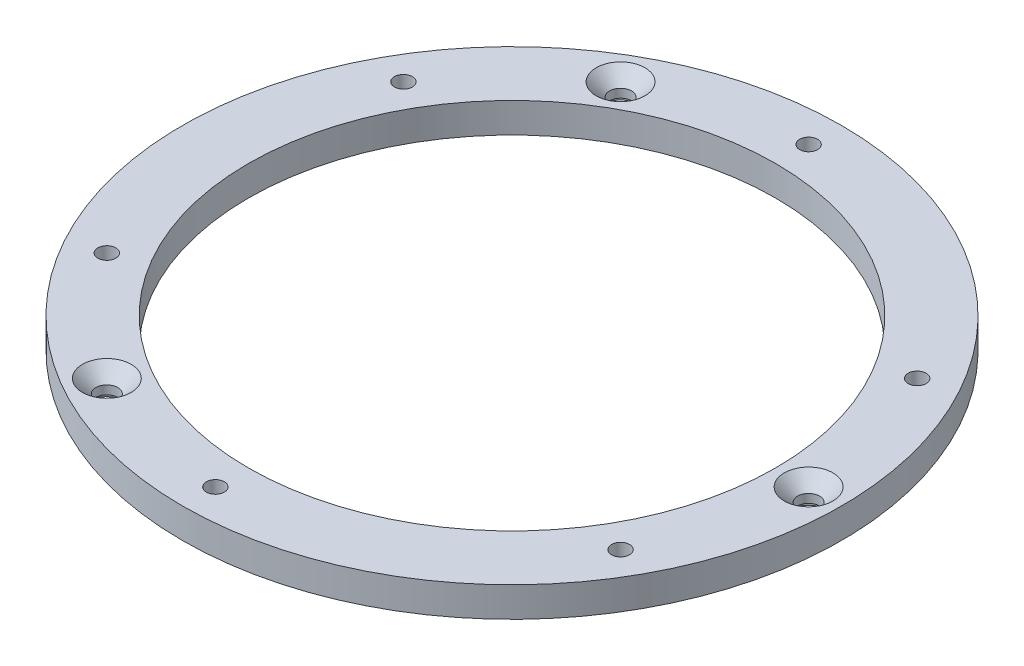
ISO-10303-21;
HEADER;
FILE_DESCRIPTION(('STEP AP214'),'2;1');
FILE_NAME('part.step','',(''),(''),'','','');
FILE_SCHEMA(('AUTOMOTIVE_DESIGN { 1 0 10303 214 1 1 1 1 }'));
ENDSEC;
DATA;
#1=APPLICATION_CONTEXT('core data for automotive mechanical design processes');
#2=APPLICATION_PROTOCOL_DEFINITION('international standard','automotive_design',2000,#1);
#3=PRODUCT_CONTEXT('',#1,'mechanical');
#4=PRODUCT('Part','Part','',(#3));
#5=PRODUCT_RELATED_PRODUCT_CATEGORY('part','',(#4));
#6=PRODUCT_DEFINITION_FORMATION('','',#4);
#7=PRODUCT_DEFINITION_CONTEXT('part definition',#1,'design');
#8=PRODUCT_DEFINITION('design','',#6,#7);
#9=PRODUCT_DEFINITION_SHAPE('','',#8);
#10=(LENGTH_UNIT() NAMED_UNIT(*) SI_UNIT(.MILLI.,.METRE.));
#11=(NAMED_UNIT(*) PLANE_ANGLE_UNIT() SI_UNIT($,.RADIAN.));
#12=(NAMED_UNIT(*) SI_UNIT($,.STERADIAN.) SOLID_ANGLE_UNIT());
#13=UNCERTAINTY_MEASURE_WITH_UNIT(LENGTH_MEASURE(1.E-05),#10,'distance_accuracy_value','');
#14=(GEOMETRIC_REPRESENTATION_CONTEXT(3) GLOBAL_UNCERTAINTY_ASSIGNED_CONTEXT((#13)) GLOBAL_UNIT_ASSIGNED_CONTEXT((#10,
#11,#12)) REPRESENTATION_CONTEXT('',''));
#15=CARTESIAN_POINT('',(0.,0.,0.));
#16=DIRECTION('',(0.,0.,1.));
#17=DIRECTION('',(1.,0.,0.));
#18=AXIS2_PLACEMENT_3D('',#15,#16,#17);
#19=CARTESIAN_POINT('',(0.,15.,0.));
#20=DIRECTION('',(0.,1.,0.));
#21=DIRECTION('',(0.,0.,1.));
#22=AXIS2_PLACEMENT_3D('',#19,#20,#21);
#23=PLANE('',#22);
#24=CARTESIAN_POINT('',(-74.2500000000016,15.,-128.604772461988));
#25=DIRECTION('',(0.,1.,0.));
#26=DIRECTION('',(0.,0.,1.));
#27=AXIS2_PLACEMENT_3D('',#24,#25,#26);
#28=CIRCLE('',#27,12.2);
#29=CARTESIAN_POINT('',(-74.2500000000016,15.,-116.404772461988));
#30=VERTEX_POINT('',#29);
#31=EDGE_CURVE('E163',#30,#30,#28,.T.);
#32=ORIENTED_EDGE('',*,*,#31,.F.);
#33=EDGE_LOOP('',(#32));
#34=FACE_BOUND('',#33,.T.);
#35=CARTESIAN_POINT('',(148.5,15.,-1.11022302462516E-12));
#36=DIRECTION('',(0.,1.,0.));
#37=DIRECTION('',(0.,0.,1.));
#38=AXIS2_PLACEMENT_3D('',#35,#36,#37);
#39=CIRCLE('',#38,12.2);
#40=CARTESIAN_POINT('',(148.5,15.,12.1999999999989));
#41=VERTEX_POINT('',#40);
#42=EDGE_CURVE('E72',#41,#41,#39,.T.);
#43=ORIENTED_EDGE('',*,*,#42,.F.);
#44=EDGE_LOOP('',(#43));
#45=FACE_BOUND('',#44,.T.);
#46=CARTESIAN_POINT('',(-74.2499999999998,15.,128.60477246199));
#47=DIRECTION('',(0.,1.,0.));
#48=DIRECTION('',(0.,0.,1.));
#49=AXIS2_PLACEMENT_3D('',#46,#47,#48);
#50=CIRCLE('',#49,12.2);
#51=CARTESIAN_POINT('',(-74.2499999999998,15.,140.80477246199));
#52=VERTEX_POINT('',#51);
#53=EDGE_CURVE('E83',#52,#52,#50,.T.);
#54=ORIENTED_EDGE('',*,*,#53,.F.);
#55=EDGE_LOOP('',(#54));
#56=FACE_BOUND('',#55,.T.);
#57=CARTESIAN_POINT('',(128.604772461988,15.,-74.2500000000016));
#58=DIRECTION('',(0.,-1.,0.));
#59=DIRECTION('',(0.,0.,-1.));
#60=AXIS2_PLACEMENT_3D('',#57,#58,#59);
#61=CIRCLE('',#60,4.5);
#62=CARTESIAN_POINT('',(128.604772461988,15.,-78.7500000000016));
#63=VERTEX_POINT('',#62);
#64=EDGE_CURVE('E101',#63,#63,#61,.T.);
#65=ORIENTED_EDGE('',*,*,#64,.T.);
#66=EDGE_LOOP('',(#65));
#67=FACE_BOUND('',#66,.T.);
#68=CARTESIAN_POINT('',(128.60477246199,15.,74.2499999999989));
#69=DIRECTION('',(0.,-1.,0.));
#70=DIRECTION('',(0.,0.,-1.));
#71=AXIS2_PLACEMENT_3D('',#68,#69,#70);
#72=CIRCLE('',#71,4.5);
#73=CARTESIAN_POINT('',(128.60477246199,15.,69.7499999999989));
#74=VERTEX_POINT('',#73);
#75=EDGE_CURVE('E107',#74,#74,#72,.T.);
#76=ORIENTED_EDGE('',*,*,#75,.T.);
#77=EDGE_LOOP('',(#76));
#78=FACE_BOUND('',#77,.T.);
#79=CARTESIAN_POINT('',(0.,15.,148.5));
#80=DIRECTION('',(0.,-1.,0.));
#81=DIRECTION('',(0.,0.,-1.));
#82=AXIS2_PLACEMENT_3D('',#79,#80,#81);
#83=CIRCLE('',#82,4.5);
#84=CARTESIAN_POINT('',(0.,15.,144.));
#85=VERTEX_POINT('',#84);
#86=EDGE_CURVE('E113',#85,#85,#83,.T.);
#87=ORIENTED_EDGE('',*,*,#86,.T.);
#88=EDGE_LOOP('',(#87));
#89=FACE_BOUND('',#88,.T.);
#90=CARTESIAN_POINT('',(-128.604772461989,15.,74.2500000000007));
#91=DIRECTION('',(0.,-1.,0.));
#92=DIRECTION('',(0.,0.,-1.));
#93=AXIS2_PLACEMENT_3D('',#90,#91,#92);
#94=CIRCLE('',#93,4.5);
#95=CARTESIAN_POINT('',(-128.604772461989,15.,69.7500000000007));
#96=VERTEX_POINT('',#95);
#97=EDGE_CURVE('E119',#96,#96,#94,.T.);
#98=ORIENTED_EDGE('',*,*,#97,.T.);
#99=EDGE_LOOP('',(#98));
#100=FACE_BOUND('',#99,.T.);
#101=CARTESIAN_POINT('',(-128.60477246199,15.,-74.2499999999998));
#102=DIRECTION('',(0.,-1.,0.));
#103=DIRECTION('',(0.,0.,-1.));
#104=AXIS2_PLACEMENT_3D('',#101,#102,#103);
#105=CIRCLE('',#104,4.5);
#106=CARTESIAN_POINT('',(-128.60477246199,15.,-78.7499999999998));
#107=VERTEX_POINT('',#106);
#108=EDGE_CURVE('E125',#107,#107,#105,.T.);
#109=ORIENTED_EDGE('',*,*,#108,.T.);
#110=EDGE_LOOP('',(#109));
#111=FACE_BOUND('',#110,.T.);
#112=CARTESIAN_POINT('',(0.,15.,-148.5));
#113=DIRECTION('',(0.,-1.,0.));
#114=DIRECTION('',(0.,0.,-1.));
#115=AXIS2_PLACEMENT_3D('',#112,#113,#114);
#116=CIRCLE('',#115,4.5);
#117=CARTESIAN_POINT('',(0.,15.,-153.));
#118=VERTEX_POINT('',#117);
#119=EDGE_CURVE('E131',#118,#118,#116,.T.);
#120=ORIENTED_EDGE('',*,*,#119,.T.);
#121=EDGE_LOOP('',(#120));
#122=FACE_BOUND('',#121,.T.);
#123=CARTESIAN_POINT('',(0.,15.,0.));
#124=DIRECTION('',(0.,1.,0.));
#125=DIRECTION('',(0.,0.,1.));
#126=AXIS2_PLACEMENT_3D('',#123,#124,#125);
#127=CIRCLE('',#126,165.);
#128=CARTESIAN_POINT('',(0.,15.,165.));
#129=VERTEX_POINT('',#128);
#130=EDGE_CURVE('E10',#129,#129,#127,.T.);
#131=ORIENTED_EDGE('',*,*,#130,.T.);
#132=EDGE_LOOP('',(#131));
#133=FACE_BOUND('',#132,.T.);
#134=CARTESIAN_POINT('',(0.,15.,0.));
#135=DIRECTION('',(0.,1.,0.));
#136=DIRECTION('',(0.,0.,1.));
#137=AXIS2_PLACEMENT_3D('',#134,#135,#136);
#138=CIRCLE('',#137,132.);
#139=CARTESIAN_POINT('',(0.,15.,132.));
#140=VERTEX_POINT('',#139);
#141=EDGE_CURVE('E52',#140,#140,#138,.T.);
#142=ORIENTED_EDGE('',*,*,#141,.F.);
#143=EDGE_LOOP('',(#142));
#144=FACE_BOUND('',#143,.T.);
#145=ADVANCED_FACE('F39',(#34,#45,#56,#67,#78,#89,#100,#111,#122,#133,#144),#23,.T.);
#146=CARTESIAN_POINT('',(0.,0.,0.));
#147=DIRECTION('',(0.,1.,0.));
#148=DIRECTION('',(0.,0.,1.));
#149=AXIS2_PLACEMENT_3D('',#146,#147,#148);
#150=PLANE('',#149);
#151=CARTESIAN_POINT('',(148.5,0.,-1.11022302462516E-12));
#152=DIRECTION('',(0.,-1.,0.));
#153=DIRECTION('',(-0.866025403784438,0.,0.500000000000005));
#154=AXIS2_PLACEMENT_3D('',#151,#152,#153);
#155=CIRCLE('',#154,9.99999999999998);
#156=CARTESIAN_POINT('',(139.839745962156,0.,4.99999999999893));
#157=VERTEX_POINT('',#156);
#158=EDGE_CURVE('E84',#157,#157,#155,.T.);
#159=ORIENTED_EDGE('',*,*,#158,.F.);
#160=EDGE_LOOP('',(#159));
#161=FACE_BOUND('',#160,.T.);
#162=CARTESIAN_POINT('',(-74.2500000000016,0.,-128.604772461988));
#163=DIRECTION('',(0.,-1.,0.));
#164=DIRECTION('',(0.866025403784445,0.,0.499999999999993));
#165=AXIS2_PLACEMENT_3D('',#162,#163,#164);
#166=CIRCLE('',#165,9.99999999999998);
#167=CARTESIAN_POINT('',(-65.5897459621572,0.,-123.604772461988));
#168=VERTEX_POINT('',#167);
#169=EDGE_CURVE('E64',#168,#168,#166,.T.);
#170=ORIENTED_EDGE('',*,*,#169,.F.);
#171=EDGE_LOOP('',(#170));
#172=FACE_BOUND('',#171,.T.);
#173=CARTESIAN_POINT('',(-74.2499999999998,0.,128.60477246199));
#174=DIRECTION('',(0.,-1.,0.));
#175=DIRECTION('',(0.,0.,-1.));
#176=AXIS2_PLACEMENT_3D('',#173,#174,#175);
#177=CIRCLE('',#176,9.99999999999998);
#178=CARTESIAN_POINT('',(-74.2499999999998,0.,118.60477246199));
#179=VERTEX_POINT('',#178);
#180=EDGE_CURVE('E60',#179,#179,#177,.T.);
#181=ORIENTED_EDGE('',*,*,#180,.F.);
#182=EDGE_LOOP('',(#181));
#183=FACE_BOUND('',#182,.T.);
#184=CARTESIAN_POINT('',(128.604772461988,0.,-74.2500000000016));
#185=DIRECTION('',(0.,-1.,0.));
#186=DIRECTION('',(0.,0.,-1.));
#187=AXIS2_PLACEMENT_3D('',#184,#185,#186);
#188=CIRCLE('',#187,4.5);
#189=CARTESIAN_POINT('',(128.604772461988,0.,-78.7500000000016));
#190=VERTEX_POINT('',#189);
#191=EDGE_CURVE('E96',#190,#190,#188,.T.);
#192=ORIENTED_EDGE('',*,*,#191,.F.);
#193=EDGE_LOOP('',(#192));
#194=FACE_BOUND('',#193,.T.);
#195=CARTESIAN_POINT('',(128.60477246199,0.,74.2499999999989));
#196=DIRECTION('',(0.,-1.,0.));
#197=DIRECTION('',(0.,0.,-1.));
#198=AXIS2_PLACEMENT_3D('',#195,#196,#197);
#199=CIRCLE('',#198,4.5);
#200=CARTESIAN_POINT('',(128.60477246199,0.,69.7499999999989));
#201=VERTEX_POINT('',#200);
#202=EDGE_CURVE('E104',#201,#201,#199,.T.);
#203=ORIENTED_EDGE('',*,*,#202,.F.);
#204=EDGE_LOOP('',(#203));
#205=FACE_BOUND('',#204,.T.);
#206=CARTESIAN_POINT('',(0.,0.,148.5));
#207=DIRECTION('',(0.,-1.,0.));
#208=DIRECTION('',(0.,0.,-1.));
#209=AXIS2_PLACEMENT_3D('',#206,#207,#208);
#210=CIRCLE('',#209,4.5);
#211=CARTESIAN_POINT('',(0.,0.,144.));
#212=VERTEX_POINT('',#211);
#213=EDGE_CURVE('E110',#212,#212,#210,.T.);
#214=ORIENTED_EDGE('',*,*,#213,.F.);
#215=EDGE_LOOP('',(#214));
#216=FACE_BOUND('',#215,.T.);
#217=CARTESIAN_POINT('',(-128.604772461989,0.,74.2500000000007));
#218=DIRECTION('',(0.,-1.,0.));
#219=DIRECTION('',(0.,0.,-1.));
#220=AXIS2_PLACEMENT_3D('',#217,#218,#219);
#221=CIRCLE('',#220,4.5);
#222=CARTESIAN_POINT('',(-128.604772461989,0.,69.7500000000007));
#223=VERTEX_POINT('',#222);
#224=EDGE_CURVE('E116',#223,#223,#221,.T.);
#225=ORIENTED_EDGE('',*,*,#224,.F.);
#226=EDGE_LOOP('',(#225));
#227=FACE_BOUND('',#226,.T.);
#228=CARTESIAN_POINT('',(-128.60477246199,0.,-74.2499999999998));
#229=DIRECTION('',(0.,-1.,0.));
#230=DIRECTION('',(0.,0.,-1.));
#231=AXIS2_PLACEMENT_3D('',#228,#229,#230);
#232=CIRCLE('',#231,4.5);
#233=CARTESIAN_POINT('',(-128.60477246199,0.,-78.7499999999998));
#234=VERTEX_POINT('',#233);
#235=EDGE_CURVE('E122',#234,#234,#232,.T.);
#236=ORIENTED_EDGE('',*,*,#235,.F.);
#237=EDGE_LOOP('',(#236));
#238=FACE_BOUND('',#237,.T.);
#239=CARTESIAN_POINT('',(0.,0.,-148.5));
#240=DIRECTION('',(0.,-1.,0.));
#241=DIRECTION('',(0.,0.,-1.));
#242=AXIS2_PLACEMENT_3D('',#239,#240,#241);
#243=CIRCLE('',#242,4.5);
#244=CARTESIAN_POINT('',(0.,0.,-153.));
#245=VERTEX_POINT('',#244);
#246=EDGE_CURVE('E128',#245,#245,#243,.T.);
#247=ORIENTED_EDGE('',*,*,#246,.F.);
#248=EDGE_LOOP('',(#247));
#249=FACE_BOUND('',#248,.T.);
#250=CARTESIAN_POINT('',(0.,0.,0.));
#251=DIRECTION('',(0.,1.,0.));
#252=DIRECTION('',(0.,0.,1.));
#253=AXIS2_PLACEMENT_3D('',#250,#251,#252);
#254=CIRCLE('',#253,165.);
#255=CARTESIAN_POINT('',(0.,0.,165.));
#256=VERTEX_POINT('',#255);
#257=EDGE_CURVE('E47',#256,#256,#254,.T.);
#258=ORIENTED_EDGE('',*,*,#257,.F.);
#259=EDGE_LOOP('',(#258));
#260=FACE_BOUND('',#259,.T.);
#261=CARTESIAN_POINT('',(0.,0.,0.));
#262=DIRECTION('',(0.,1.,0.));
#263=DIRECTION('',(0.,0.,1.));
#264=AXIS2_PLACEMENT_3D('',#261,#262,#263);
#265=CIRCLE('',#264,132.);
#266=CARTESIAN_POINT('',(0.,0.,132.));
#267=VERTEX_POINT('',#266);
#268=EDGE_CURVE('E55',#267,#267,#265,.T.);
#269=ORIENTED_EDGE('',*,*,#268,.T.);
#270=EDGE_LOOP('',(#269));
#271=FACE_BOUND('',#270,.T.);
#272=ADVANCED_FACE('F139',(#161,#172,#183,#194,#205,#216,#227,#238,#249,#260,#271),#150,.F.);
#273=CARTESIAN_POINT('',(0.,15.,0.));
#274=DIRECTION('',(0.,-1.,0.));
#275=DIRECTION('',(0.,0.,-1.));
#276=AXIS2_PLACEMENT_3D('',#273,#274,#275);
#277=CYLINDRICAL_SURFACE('',#276,165.);
#278=ORIENTED_EDGE('',*,*,#130,.F.);
#279=EDGE_LOOP('',(#278));
#280=FACE_BOUND('',#279,.T.);
#281=ORIENTED_EDGE('',*,*,#257,.T.);
#282=EDGE_LOOP('',(#281));
#283=FACE_BOUND('',#282,.T.);
#284=ADVANCED_FACE('F41',(#280,#283),#277,.T.);
#285=CARTESIAN_POINT('',(0.,15.,0.));
#286=DIRECTION('',(0.,-1.,0.));
#287=DIRECTION('',(0.,0.,-1.));
#288=AXIS2_PLACEMENT_3D('',#285,#286,#287);
#289=CYLINDRICAL_SURFACE('',#288,132.);
#290=ORIENTED_EDGE('',*,*,#141,.T.);
#291=EDGE_LOOP('',(#290));
#292=FACE_BOUND('',#291,.T.);
#293=ORIENTED_EDGE('',*,*,#268,.F.);
#294=EDGE_LOOP('',(#293));
#295=FACE_BOUND('',#294,.T.);
#296=ADVANCED_FACE('F141',(#292,#295),#289,.F.);
#297=CARTESIAN_POINT('',(0.,0.,-148.5));
#298=DIRECTION('',(0.,-1.,0.));
#299=DIRECTION('',(0.,0.,-1.));
#300=AXIS2_PLACEMENT_3D('',#297,#298,#299);
#301=CYLINDRICAL_SURFACE('',#300,4.5);
#302=ORIENTED_EDGE('',*,*,#119,.F.);
#303=EDGE_LOOP('',(#302));
#304=FACE_BOUND('',#303,.T.);
#305=ORIENTED_EDGE('',*,*,#246,.T.);
#306=EDGE_LOOP('',(#305));
#307=FACE_BOUND('',#306,.T.);
#308=ADVANCED_FACE('F143',(#304,#307),#301,.F.);
#309=CARTESIAN_POINT('',(-128.60477246199,0.,-74.2499999999998));
#310=DIRECTION('',(0.,-1.,0.));
#311=DIRECTION('',(0.,0.,-1.));
#312=AXIS2_PLACEMENT_3D('',#309,#310,#311);
#313=CYLINDRICAL_SURFACE('',#312,4.5);
#314=ORIENTED_EDGE('',*,*,#108,.F.);
#315=EDGE_LOOP('',(#314));
#316=FACE_BOUND('',#315,.T.);
#317=ORIENTED_EDGE('',*,*,#235,.T.);
#318=EDGE_LOOP('',(#317));
#319=FACE_BOUND('',#318,.T.);
#320=ADVANCED_FACE('F149',(#316,#319),#313,.F.);
#321=CARTESIAN_POINT('',(-128.604772461989,0.,74.2500000000007));
#322=DIRECTION('',(0.,-1.,0.));
#323=DIRECTION('',(0.,0.,-1.));
#324=AXIS2_PLACEMENT_3D('',#321,#322,#323);
#325=CYLINDRICAL_SURFACE('',#324,4.5);
#326=ORIENTED_EDGE('',*,*,#97,.F.);
#327=EDGE_LOOP('',(#326));
#328=FACE_BOUND('',#327,.T.);
#329=ORIENTED_EDGE('',*,*,#224,.T.);
#330=EDGE_LOOP('',(#329));
#331=FACE_BOUND('',#330,.T.);
#332=ADVANCED_FACE('F189',(#328,#331),#325,.F.);
#333=CARTESIAN_POINT('',(0.,0.,148.5));
#334=DIRECTION('',(0.,-1.,0.));
#335=DIRECTION('',(0.,0.,-1.));
#336=AXIS2_PLACEMENT_3D('',#333,#334,#335);
#337=CYLINDRICAL_SURFACE('',#336,4.5);
#338=ORIENTED_EDGE('',*,*,#86,.F.);
#339=EDGE_LOOP('',(#338));
#340=FACE_BOUND('',#339,.T.);
#341=ORIENTED_EDGE('',*,*,#213,.T.);
#342=EDGE_LOOP('',(#341));
#343=FACE_BOUND('',#342,.T.);
#344=ADVANCED_FACE('F196',(#340,#343),#337,.F.);
#345=CARTESIAN_POINT('',(128.60477246199,0.,74.2499999999989));
#346=DIRECTION('',(0.,-1.,0.));
#347=DIRECTION('',(0.,0.,-1.));
#348=AXIS2_PLACEMENT_3D('',#345,#346,#347);
#349=CYLINDRICAL_SURFACE('',#348,4.5);
#350=ORIENTED_EDGE('',*,*,#75,.F.);
#351=EDGE_LOOP('',(#350));
#352=FACE_BOUND('',#351,.T.);
#353=ORIENTED_EDGE('',*,*,#202,.T.);
#354=EDGE_LOOP('',(#353));
#355=FACE_BOUND('',#354,.T.);
#356=ADVANCED_FACE('F202',(#352,#355),#349,.F.);
#357=CARTESIAN_POINT('',(128.604772461988,0.,-74.2500000000016));
#358=DIRECTION('',(0.,-1.,0.));
#359=DIRECTION('',(0.,0.,-1.));
#360=AXIS2_PLACEMENT_3D('',#357,#358,#359);
#361=CYLINDRICAL_SURFACE('',#360,4.5);
#362=ORIENTED_EDGE('',*,*,#64,.F.);
#363=EDGE_LOOP('',(#362));
#364=FACE_BOUND('',#363,.T.);
#365=ORIENTED_EDGE('',*,*,#191,.T.);
#366=EDGE_LOOP('',(#365));
#367=FACE_BOUND('',#366,.T.);
#368=ADVANCED_FACE('F206',(#364,#367),#361,.F.);
#369=CARTESIAN_POINT('',(-74.2499999999998,4.,128.60477246199));
#370=DIRECTION('',(0.,-1.,0.));
#371=DIRECTION('',(0.,0.,-1.));
#372=AXIS2_PLACEMENT_3D('',#369,#370,#371);
#373=CYLINDRICAL_SURFACE('',#372,9.99999999999998);
#374=CARTESIAN_POINT('',(-74.2499999999998,4.,128.60477246199));
#375=DIRECTION('',(0.,-1.,0.));
#376=DIRECTION('',(0.,0.,-1.));
#377=AXIS2_PLACEMENT_3D('',#374,#375,#376);
#378=CIRCLE('',#377,9.99999999999998);
#379=CARTESIAN_POINT('',(-74.2499999999998,4.,118.60477246199));
#380=VERTEX_POINT('',#379);
#381=EDGE_CURVE('E93',#380,#380,#378,.T.);
#382=ORIENTED_EDGE('',*,*,#381,.F.);
#383=EDGE_LOOP('',(#382));
#384=FACE_BOUND('',#383,.T.);
#385=ORIENTED_EDGE('',*,*,#180,.T.);
#386=EDGE_LOOP('',(#385));
#387=FACE_BOUND('',#386,.T.);
#388=ADVANCED_FACE('F210',(#384,#387),#373,.F.);
#389=CARTESIAN_POINT('',(-74.2499999999998,4.,128.60477246199));
#390=DIRECTION('',(0.,-1.,0.));
#391=DIRECTION('',(0.,0.,-1.));
#392=AXIS2_PLACEMENT_3D('',#389,#390,#391);
#393=PLANE('',#392);
#394=CARTESIAN_POINT('',(-74.2499999999998,4.,128.60477246199));
#395=DIRECTION('',(0.,-1.,0.));
#396=DIRECTION('',(0.,0.,-1.));
#397=AXIS2_PLACEMENT_3D('',#394,#395,#396);
#398=CIRCLE('',#397,5.49999999999999);
#399=CARTESIAN_POINT('',(-74.2499999999998,4.,123.10477246199));
#400=VERTEX_POINT('',#399);
#401=EDGE_CURVE('E58',#400,#400,#398,.T.);
#402=ORIENTED_EDGE('',*,*,#401,.F.);
#403=EDGE_LOOP('',(#402));
#404=FACE_BOUND('',#403,.T.);
#405=ORIENTED_EDGE('',*,*,#381,.T.);
#406=EDGE_LOOP('',(#405));
#407=FACE_BOUND('',#406,.T.);
#408=ADVANCED_FACE('F214',(#404,#407),#393,.T.);
#409=CARTESIAN_POINT('',(-74.2499999999998,15.,128.60477246199));
#410=DIRECTION('',(0.,1.,0.));
#411=DIRECTION('',(0.,0.,1.));
#412=AXIS2_PLACEMENT_3D('',#409,#410,#411);
#413=CYLINDRICAL_SURFACE('',#412,5.49999999999999);
#414=ORIENTED_EDGE('',*,*,#401,.T.);
#415=EDGE_LOOP('',(#414));
#416=FACE_BOUND('',#415,.T.);
#417=CARTESIAN_POINT('',(-74.2499999999998,8.30000000000003,128.60477246199));
#418=DIRECTION('',(0.,1.,0.));
#419=DIRECTION('',(0.,0.,1.));
#420=AXIS2_PLACEMENT_3D('',#417,#418,#419);
#421=CIRCLE('',#420,5.49999999999999);
#422=CARTESIAN_POINT('',(-74.2499999999998,8.30000000000003,134.10477246199));
#423=VERTEX_POINT('',#422);
#424=EDGE_CURVE('E61',#423,#423,#421,.T.);
#425=ORIENTED_EDGE('',*,*,#424,.T.);
#426=EDGE_LOOP('',(#425));
#427=FACE_BOUND('',#426,.T.);
#428=ADVANCED_FACE('F218',(#416,#427),#413,.F.);
#429=CARTESIAN_POINT('',(-74.2499999999998,15.,128.60477246199));
#430=DIRECTION('',(0.,1.,0.));
#431=DIRECTION('',(0.,0.,1.));
#432=AXIS2_PLACEMENT_3D('',#429,#430,#431);
#433=CONICAL_SURFACE('',#432,12.2,0.78539816339745);
#434=ORIENTED_EDGE('',*,*,#424,.F.);
#435=EDGE_LOOP('',(#434));
#436=FACE_BOUND('',#435,.T.);
#437=ORIENTED_EDGE('',*,*,#53,.T.);
#438=EDGE_LOOP('',(#437));
#439=FACE_BOUND('',#438,.T.);
#440=ADVANCED_FACE('F222',(#436,#439),#433,.F.);
#441=CARTESIAN_POINT('',(-74.2500000000016,4.,-128.604772461988));
#442=DIRECTION('',(0.,-1.,0.));
#443=DIRECTION('',(0.,0.,-1.));
#444=AXIS2_PLACEMENT_3D('',#441,#442,#443);
#445=CYLINDRICAL_SURFACE('',#444,9.99999999999998);
#446=CARTESIAN_POINT('',(-74.2500000000016,4.,-128.604772461988));
#447=DIRECTION('',(0.,-1.,0.));
#448=DIRECTION('',(0.866025403784445,0.,0.499999999999993));
#449=AXIS2_PLACEMENT_3D('',#446,#447,#448);
#450=CIRCLE('',#449,9.99999999999998);
#451=CARTESIAN_POINT('',(-65.5897459621572,4.,-123.604772461988));
#452=VERTEX_POINT('',#451);
#453=EDGE_CURVE('E69',#452,#452,#450,.T.);
#454=ORIENTED_EDGE('',*,*,#453,.F.);
#455=EDGE_LOOP('',(#454));
#456=FACE_BOUND('',#455,.T.);
#457=ORIENTED_EDGE('',*,*,#169,.T.);
#458=EDGE_LOOP('',(#457));
#459=FACE_BOUND('',#458,.T.);
#460=ADVANCED_FACE('F226',(#456,#459),#445,.F.);
#461=CARTESIAN_POINT('',(-74.2500000000016,4.,-128.604772461988));
#462=DIRECTION('',(0.,-1.,0.));
#463=DIRECTION('',(0.866025403784445,0.,0.499999999999993));
#464=AXIS2_PLACEMENT_3D('',#461,#462,#463);
#465=PLANE('',#464);
#466=CARTESIAN_POINT('',(-74.2500000000016,4.,-128.604772461988));
#467=DIRECTION('',(0.,-1.,0.));
#468=DIRECTION('',(0.,0.,-1.));
#469=AXIS2_PLACEMENT_3D('',#466,#467,#468);
#470=CIRCLE('',#469,5.49999999999999);
#471=CARTESIAN_POINT('',(-74.2500000000016,4.,-134.104772461988));
#472=VERTEX_POINT('',#471);
#473=EDGE_CURVE('E43',#472,#472,#470,.T.);
#474=ORIENTED_EDGE('',*,*,#473,.F.);
#475=EDGE_LOOP('',(#474));
#476=FACE_BOUND('',#475,.T.);
#477=ORIENTED_EDGE('',*,*,#453,.T.);
#478=EDGE_LOOP('',(#477));
#479=FACE_BOUND('',#478,.T.);
#480=ADVANCED_FACE('F230',(#476,#479),#465,.T.);
#481=CARTESIAN_POINT('',(148.5,4.,-1.11022302462516E-12));
#482=DIRECTION('',(0.,-1.,0.));
#483=DIRECTION('',(0.,0.,-1.));
#484=AXIS2_PLACEMENT_3D('',#481,#482,#483);
#485=CYLINDRICAL_SURFACE('',#484,9.99999999999998);
#486=CARTESIAN_POINT('',(148.5,4.,-1.11022302462516E-12));
#487=DIRECTION('',(0.,-1.,0.));
#488=DIRECTION('',(-0.866025403784438,0.,0.500000000000005));
#489=AXIS2_PLACEMENT_3D('',#486,#487,#488);
#490=CIRCLE('',#489,9.99999999999998);
#491=CARTESIAN_POINT('',(139.839745962156,4.,4.99999999999893));
#492=VERTEX_POINT('',#491);
#493=EDGE_CURVE('E80',#492,#492,#490,.T.);
#494=ORIENTED_EDGE('',*,*,#493,.F.);
#495=EDGE_LOOP('',(#494));
#496=FACE_BOUND('',#495,.T.);
#497=ORIENTED_EDGE('',*,*,#158,.T.);
#498=EDGE_LOOP('',(#497));
#499=FACE_BOUND('',#498,.T.);
#500=ADVANCED_FACE('F234',(#496,#499),#485,.F.);
#501=CARTESIAN_POINT('',(148.5,4.,-1.11022302462516E-12));
#502=DIRECTION('',(0.,-1.,0.));
#503=DIRECTION('',(-0.866025403784438,0.,0.500000000000005));
#504=AXIS2_PLACEMENT_3D('',#501,#502,#503);
#505=PLANE('',#504);
#506=CARTESIAN_POINT('',(148.5,4.,-1.11022302462516E-12));
#507=DIRECTION('',(0.,-1.,0.));
#508=DIRECTION('',(0.,0.,-1.));
#509=AXIS2_PLACEMENT_3D('',#506,#507,#508);
#510=CIRCLE('',#509,5.50000000000001);
#511=CARTESIAN_POINT('',(148.5,4.,-5.50000000000112));
#512=VERTEX_POINT('',#511);
#513=EDGE_CURVE('E62',#512,#512,#510,.T.);
#514=ORIENTED_EDGE('',*,*,#513,.F.);
#515=EDGE_LOOP('',(#514));
#516=FACE_BOUND('',#515,.T.);
#517=ORIENTED_EDGE('',*,*,#493,.T.);
#518=EDGE_LOOP('',(#517));
#519=FACE_BOUND('',#518,.T.);
#520=ADVANCED_FACE('F238',(#516,#519),#505,.T.);
#521=CARTESIAN_POINT('',(148.5,15.,-1.11022302462516E-12));
#522=DIRECTION('',(0.,1.,0.));
#523=DIRECTION('',(0.,0.,1.));
#524=AXIS2_PLACEMENT_3D('',#521,#522,#523);
#525=CYLINDRICAL_SURFACE('',#524,5.50000000000001);
#526=ORIENTED_EDGE('',*,*,#513,.T.);
#527=EDGE_LOOP('',(#526));
#528=FACE_BOUND('',#527,.T.);
#529=CARTESIAN_POINT('',(148.5,8.30000000000003,-1.11022302462516E-12));
#530=DIRECTION('',(0.,1.,0.));
#531=DIRECTION('',(0.,0.,1.));
#532=AXIS2_PLACEMENT_3D('',#529,#530,#531);
#533=CIRCLE('',#532,5.50000000000001);
#534=CARTESIAN_POINT('',(148.5,8.30000000000003,5.4999999999989));
#535=VERTEX_POINT('',#534);
#536=EDGE_CURVE('E65',#535,#535,#533,.T.);
#537=ORIENTED_EDGE('',*,*,#536,.T.);
#538=EDGE_LOOP('',(#537));
#539=FACE_BOUND('',#538,.T.);
#540=ADVANCED_FACE('F242',(#528,#539),#525,.F.);
#541=CARTESIAN_POINT('',(148.5,15.,-1.11022302462516E-12));
#542=DIRECTION('',(0.,1.,0.));
#543=DIRECTION('',(0.,0.,1.));
#544=AXIS2_PLACEMENT_3D('',#541,#542,#543);
#545=CONICAL_SURFACE('',#544,12.2,0.785398163397447);
#546=ORIENTED_EDGE('',*,*,#536,.F.);
#547=EDGE_LOOP('',(#546));
#548=FACE_BOUND('',#547,.T.);
#549=ORIENTED_EDGE('',*,*,#42,.T.);
#550=EDGE_LOOP('',(#549));
#551=FACE_BOUND('',#550,.T.);
#552=ADVANCED_FACE('F246',(#548,#551),#545,.F.);
#553=CARTESIAN_POINT('',(-74.2500000000016,15.,-128.604772461988));
#554=DIRECTION('',(0.,1.,0.));
#555=DIRECTION('',(0.,0.,1.));
#556=AXIS2_PLACEMENT_3D('',#553,#554,#555);
#557=CYLINDRICAL_SURFACE('',#556,5.49999999999999);
#558=ORIENTED_EDGE('',*,*,#473,.T.);
#559=EDGE_LOOP('',(#558));
#560=FACE_BOUND('',#559,.T.);
#561=CARTESIAN_POINT('',(-74.2500000000016,8.30000000000003,-128.604772461988));
#562=DIRECTION('',(0.,1.,0.));
#563=DIRECTION('',(0.,0.,1.));
#564=AXIS2_PLACEMENT_3D('',#561,#562,#563);
#565=CIRCLE('',#564,5.49999999999999);
#566=CARTESIAN_POINT('',(-74.2500000000016,8.30000000000003,-123.104772461988));
#567=VERTEX_POINT('',#566);
#568=EDGE_CURVE('E262',#567,#567,#565,.T.);
#569=ORIENTED_EDGE('',*,*,#568,.T.);
#570=EDGE_LOOP('',(#569));
#571=FACE_BOUND('',#570,.T.);
#572=ADVANCED_FACE('F249',(#560,#571),#557,.F.);
#573=CARTESIAN_POINT('',(-74.2500000000016,15.,-128.604772461988));
#574=DIRECTION('',(0.,1.,0.));
#575=DIRECTION('',(0.,0.,1.));
#576=AXIS2_PLACEMENT_3D('',#573,#574,#575);
#577=CONICAL_SURFACE('',#576,12.2,0.78539816339745);
#578=ORIENTED_EDGE('',*,*,#568,.F.);
#579=EDGE_LOOP('',(#578));
#580=FACE_BOUND('',#579,.T.);
#581=ORIENTED_EDGE('',*,*,#31,.T.);
#582=EDGE_LOOP('',(#581));
#583=FACE_BOUND('',#582,.T.);
#584=ADVANCED_FACE('F253',(#580,#583),#577,.F.);
#585=CLOSED_SHELL('',(#145,#272,#284,#296,#308,#320,#332,#344,#356,#368,#388,#408,#428,#440,
#460,#480,#500,#520,#540,#552,#572,#584));
#586=MANIFOLD_SOLID_BREP('B2',#585);
#587=ADVANCED_BREP_SHAPE_REPRESENTATION('',(#18,#586),#14);
#588=SHAPE_DEFINITION_REPRESENTATION(#9,#587);
ENDSEC;
END-ISO-10303-21;
